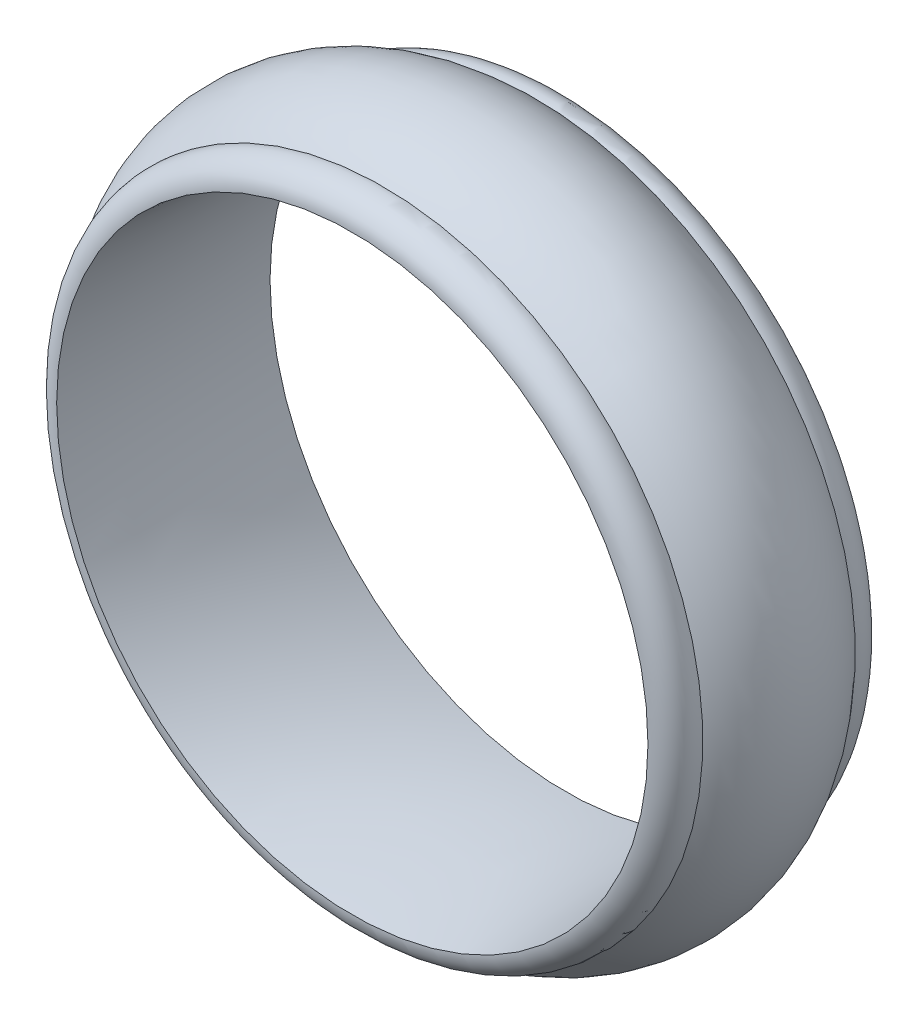
ISO-10303-21;
HEADER;
FILE_DESCRIPTION(('STEP AP214'),'2;1');
FILE_NAME('part.step','',(''),(''),'','','');
FILE_SCHEMA(('AUTOMOTIVE_DESIGN { 1 0 10303 214 1 1 1 1 }'));
ENDSEC;
DATA;
#1=APPLICATION_CONTEXT('core data for automotive mechanical design processes');
#2=APPLICATION_PROTOCOL_DEFINITION('international standard','automotive_design',2000,#1);
#3=PRODUCT_CONTEXT('',#1,'mechanical');
#4=PRODUCT('Part','Part','',(#3));
#5=PRODUCT_RELATED_PRODUCT_CATEGORY('part','',(#4));
#6=PRODUCT_DEFINITION_FORMATION('','',#4);
#7=PRODUCT_DEFINITION_CONTEXT('part definition',#1,'design');
#8=PRODUCT_DEFINITION('design','',#6,#7);
#9=PRODUCT_DEFINITION_SHAPE('','',#8);
#10=(LENGTH_UNIT() NAMED_UNIT(*) SI_UNIT(.MILLI.,.METRE.));
#11=(NAMED_UNIT(*) PLANE_ANGLE_UNIT() SI_UNIT($,.RADIAN.));
#12=(NAMED_UNIT(*) SI_UNIT($,.STERADIAN.) SOLID_ANGLE_UNIT());
#13=UNCERTAINTY_MEASURE_WITH_UNIT(LENGTH_MEASURE(1.E-05),#10,'distance_accuracy_value','');
#14=(GEOMETRIC_REPRESENTATION_CONTEXT(3) GLOBAL_UNCERTAINTY_ASSIGNED_CONTEXT((#13)) GLOBAL_UNIT_ASSIGNED_CONTEXT((#10,
#11,#12)) REPRESENTATION_CONTEXT('',''));
#15=CARTESIAN_POINT('',(0.,0.,0.));
#16=DIRECTION('',(0.,0.,1.));
#17=DIRECTION('',(1.,0.,0.));
#18=AXIS2_PLACEMENT_3D('',#15,#16,#17);
#19=CARTESIAN_POINT('',(0.,0.,0.));
#20=DIRECTION('',(0.,0.,-1.));
#21=DIRECTION('',(-1.,0.,0.));
#22=AXIS2_PLACEMENT_3D('',#19,#20,#21);
#23=TOROIDAL_SURFACE('',#22,40.2250000000002,30.7250000000002);
#24=CARTESIAN_POINT('',(0.,0.,-3.5));
#25=DIRECTION('',(0.,0.,-1.));
#26=DIRECTION('',(-1.,0.,0.));
#27=AXIS2_PLACEMENT_3D('',#24,#25,#26);
#28=CIRCLE('',#27,9.7);
#29=CARTESIAN_POINT('',(-9.7,0.,-3.5));
#30=VERTEX_POINT('',#29);
#31=EDGE_CURVE('E10',#30,#30,#28,.T.);
#32=ORIENTED_EDGE('',*,*,#31,.T.);
#33=EDGE_LOOP('',(#32));
#34=FACE_BOUND('',#33,.T.);
#35=CARTESIAN_POINT('',(0.,0.,3.5));
#36=DIRECTION('',(0.,0.,-1.));
#37=DIRECTION('',(-1.,0.,0.));
#38=AXIS2_PLACEMENT_3D('',#35,#36,#37);
#39=CIRCLE('',#38,9.7);
#40=CARTESIAN_POINT('',(-9.7,0.,3.5));
#41=VERTEX_POINT('',#40);
#42=EDGE_CURVE('E47',#41,#41,#39,.T.);
#43=ORIENTED_EDGE('',*,*,#42,.F.);
#44=EDGE_LOOP('',(#43));
#45=FACE_BOUND('',#44,.T.);
#46=ADVANCED_FACE('F33',(#34,#45),#23,.T.);
#47=CARTESIAN_POINT('',(0.,0.,-2.68));
#48=DIRECTION('',(0.,0.,-1.));
#49=DIRECTION('',(-1.,0.,0.));
#50=AXIS2_PLACEMENT_3D('',#47,#48,#49);
#51=TOROIDAL_SURFACE('',#50,9.7,0.82);
#52=CARTESIAN_POINT('',(0.,0.,-2.5));
#53=DIRECTION('',(0.,0.,-1.));
#54=DIRECTION('',(-1.,0.,0.));
#55=AXIS2_PLACEMENT_3D('',#52,#53,#54);
#56=CIRCLE('',#55,10.5);
#57=CARTESIAN_POINT('',(-10.5,0.,-2.5));
#58=VERTEX_POINT('',#57);
#59=EDGE_CURVE('E39',#58,#58,#56,.T.);
#60=ORIENTED_EDGE('',*,*,#59,.T.);
#61=EDGE_LOOP('',(#60));
#62=FACE_BOUND('',#61,.T.);
#63=ORIENTED_EDGE('',*,*,#31,.F.);
#64=EDGE_LOOP('',(#63));
#65=FACE_BOUND('',#64,.T.);
#66=ADVANCED_FACE('F57',(#62,#65),#51,.T.);
#67=CARTESIAN_POINT('',(0.,0.,0.));
#68=DIRECTION('',(0.,0.,-1.));
#69=DIRECTION('',(-1.,0.,0.));
#70=AXIS2_PLACEMENT_3D('',#67,#68,#69);
#71=TOROIDAL_SURFACE('',#70,7.875,3.625);
#72=CARTESIAN_POINT('',(0.,0.,2.5));
#73=DIRECTION('',(0.,0.,-1.));
#74=DIRECTION('',(-1.,0.,0.));
#75=AXIS2_PLACEMENT_3D('',#72,#73,#74);
#76=CIRCLE('',#75,10.5);
#77=CARTESIAN_POINT('',(-10.5,0.,2.5));
#78=VERTEX_POINT('',#77);
#79=EDGE_CURVE('E43',#78,#78,#76,.T.);
#80=ORIENTED_EDGE('',*,*,#79,.T.);
#81=EDGE_LOOP('',(#80));
#82=FACE_BOUND('',#81,.T.);
#83=ORIENTED_EDGE('',*,*,#59,.F.);
#84=EDGE_LOOP('',(#83));
#85=FACE_BOUND('',#84,.T.);
#86=ADVANCED_FACE('F61',(#82,#85),#71,.T.);
#87=CARTESIAN_POINT('',(0.,0.,2.68));
#88=DIRECTION('',(0.,0.,-1.));
#89=DIRECTION('',(-1.,0.,0.));
#90=AXIS2_PLACEMENT_3D('',#87,#88,#89);
#91=TOROIDAL_SURFACE('',#90,9.7,0.82);
#92=ORIENTED_EDGE('',*,*,#42,.T.);
#93=EDGE_LOOP('',(#92));
#94=FACE_BOUND('',#93,.T.);
#95=ORIENTED_EDGE('',*,*,#79,.F.);
#96=EDGE_LOOP('',(#95));
#97=FACE_BOUND('',#96,.T.);
#98=ADVANCED_FACE('F53',(#94,#97),#91,.T.);
#99=CLOSED_SHELL('',(#46,#66,#86,#98));
#100=MANIFOLD_SOLID_BREP('B2',#99);
#101=ADVANCED_BREP_SHAPE_REPRESENTATION('',(#18,#100),#14);
#102=SHAPE_DEFINITION_REPRESENTATION(#9,#101);
ENDSEC;
END-ISO-10303-21;
